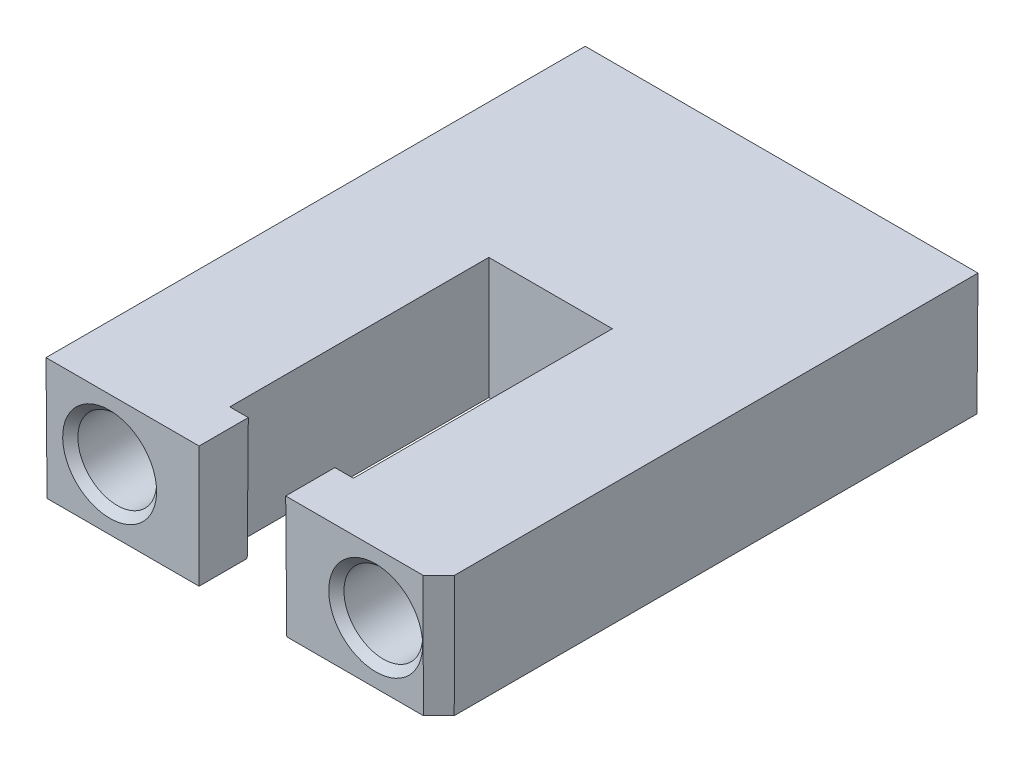
ISO-10303-21;
HEADER;
FILE_DESCRIPTION(('STEP AP214'),'2;1');
FILE_NAME('part.step','',(''),(''),'','','');
FILE_SCHEMA(('AUTOMOTIVE_DESIGN { 1 0 10303 214 1 1 1 1 }'));
ENDSEC;
DATA;
#1=APPLICATION_CONTEXT('core data for automotive mechanical design processes');
#2=APPLICATION_PROTOCOL_DEFINITION('international standard','automotive_design',2000,#1);
#3=PRODUCT_CONTEXT('',#1,'mechanical');
#4=PRODUCT('Part','Part','',(#3));
#5=PRODUCT_RELATED_PRODUCT_CATEGORY('part','',(#4));
#6=PRODUCT_DEFINITION_FORMATION('','',#4);
#7=PRODUCT_DEFINITION_CONTEXT('part definition',#1,'design');
#8=PRODUCT_DEFINITION('design','',#6,#7);
#9=PRODUCT_DEFINITION_SHAPE('','',#8);
#10=(LENGTH_UNIT() NAMED_UNIT(*) SI_UNIT(.MILLI.,.METRE.));
#11=(NAMED_UNIT(*) PLANE_ANGLE_UNIT() SI_UNIT($,.RADIAN.));
#12=(NAMED_UNIT(*) SI_UNIT($,.STERADIAN.) SOLID_ANGLE_UNIT());
#13=UNCERTAINTY_MEASURE_WITH_UNIT(LENGTH_MEASURE(1.E-05),#10,'distance_accuracy_value','');
#14=(GEOMETRIC_REPRESENTATION_CONTEXT(3) GLOBAL_UNCERTAINTY_ASSIGNED_CONTEXT((#13)) GLOBAL_UNIT_ASSIGNED_CONTEXT((#10,
#11,#12)) REPRESENTATION_CONTEXT('',''));
#15=CARTESIAN_POINT('',(0.,0.,0.));
#16=DIRECTION('',(0.,0.,1.));
#17=DIRECTION('',(1.,0.,0.));
#18=AXIS2_PLACEMENT_3D('',#15,#16,#17);
#19=CARTESIAN_POINT('',(-12.6746,3.937,0.));
#20=DIRECTION('',(0.,-0.00436330928474658,0.999990480720734));
#21=DIRECTION('',(0.,-0.999990480720734,-0.00436330928474658));
#22=AXIS2_PLACEMENT_3D('',#19,#20,#21);
#23=PLANE('',#22);
#24=CARTESIAN_POINT('',(-8.5852,0.0132247892107933,-0.0171208077862457));
#25=DIRECTION('',(0.,-0.00436330928474658,0.999990480720734));
#26=DIRECTION('',(0.,0.999990480720734,0.00436330928474658));
#27=AXIS2_PLACEMENT_3D('',#24,#25,#26);
#28=ELLIPSE('',#27,3.03090804427385,3.030850339879);
#29=CARTESIAN_POINT('',(-8.5852,3.04410398142455,-0.00389601857545247));
#30=VERTEX_POINT('',#29);
#31=EDGE_CURVE('E40',#30,#30,#28,.F.);
#32=ORIENTED_EDGE('',*,*,#31,.T.);
#33=EDGE_LOOP('',(#32));
#34=FACE_BOUND('',#33,.T.);
#35=DIRECTION('',(-0.00436326774997777,-0.999980961713314,-0.00436326774997774));
#36=VECTOR('',#35,1.);
#37=CARTESIAN_POINT('',(-2.794,3.937,0.));
#38=LINE('',#37,#36);
#39=CARTESIAN_POINT('',(-2.8283570243622,-3.937,-0.0343570243622042));
#40=VERTEX_POINT('',#39);
#41=CARTESIAN_POINT('',(-2.794,3.937,0.));
#42=VERTEX_POINT('',#41);
#43=EDGE_CURVE('E122',#40,#42,#38,.F.);
#44=ORIENTED_EDGE('',*,*,#43,.T.);
#45=DIRECTION('',(-1.,0.,0.));
#46=VECTOR('',#45,1.);
#47=CARTESIAN_POINT('',(-12.6746,3.937,0.));
#48=LINE('',#47,#46);
#49=CARTESIAN_POINT('',(-12.6746,3.937,0.));
#50=VERTEX_POINT('',#49);
#51=EDGE_CURVE('E117',#42,#50,#48,.T.);
#52=ORIENTED_EDGE('',*,*,#51,.T.);
#53=DIRECTION('',(0.00436326774997771,-0.999980961713314,-0.00436326774997774));
#54=VECTOR('',#53,1.);
#55=CARTESIAN_POINT('',(-12.6746,3.937,0.));
#56=LINE('',#55,#54);
#57=CARTESIAN_POINT('',(-12.6402429756378,-3.937,-0.0343570243622042));
#58=VERTEX_POINT('',#57);
#59=EDGE_CURVE('E121',#50,#58,#56,.T.);
#60=ORIENTED_EDGE('',*,*,#59,.T.);
#61=DIRECTION('',(1.,0.,0.));
#62=VECTOR('',#61,1.);
#63=CARTESIAN_POINT('',(-12.6746,-3.937,-0.0343570243622042));
#64=LINE('',#63,#62);
#65=EDGE_CURVE('E126',#58,#40,#64,.T.);
#66=ORIENTED_EDGE('',*,*,#65,.T.);
#67=EDGE_LOOP('',(#44,#52,#60,#66));
#68=FACE_BOUND('',#67,.T.);
#69=ADVANCED_FACE('F36',(#34,#68),#23,.T.);
#70=CARTESIAN_POINT('',(-12.6746,3.937,-34.798));
#71=DIRECTION('',(-0.999990480720734,-0.00436330928474655,0.));
#72=DIRECTION('',(0.00436330928474655,-0.999990480720734,0.));
#73=AXIS2_PLACEMENT_3D('',#70,#71,#72);
#74=PLANE('',#73);
#75=ORIENTED_EDGE('',*,*,#59,.F.);
#76=DIRECTION('',(0.,0.,1.));
#77=VECTOR('',#76,1.);
#78=CARTESIAN_POINT('',(-12.6746,3.937,-34.798));
#79=LINE('',#78,#77);
#80=CARTESIAN_POINT('',(-12.6746,3.937,-34.798));
#81=VERTEX_POINT('',#80);
#82=EDGE_CURVE('E128',#81,#50,#79,.T.);
#83=ORIENTED_EDGE('',*,*,#82,.F.);
#84=DIRECTION('',(-0.00436326774997771,0.999980961713314,-0.00436326774997774));
#85=VECTOR('',#84,1.);
#86=CARTESIAN_POINT('',(-12.6746,3.937,-34.798));
#87=LINE('',#86,#85);
#88=CARTESIAN_POINT('',(-12.6402429756378,-3.937,-34.7636429756378));
#89=VERTEX_POINT('',#88);
#90=EDGE_CURVE('E154',#81,#89,#87,.F.);
#91=ORIENTED_EDGE('',*,*,#90,.T.);
#92=DIRECTION('',(0.,0.,1.));
#93=VECTOR('',#92,1.);
#94=CARTESIAN_POINT('',(-12.6402429756378,-3.937,-34.798));
#95=LINE('',#94,#93);
#96=EDGE_CURVE('E139',#89,#58,#95,.T.);
#97=ORIENTED_EDGE('',*,*,#96,.T.);
#98=EDGE_LOOP('',(#75,#83,#91,#97));
#99=FACE_BOUND('',#98,.T.);
#100=ADVANCED_FACE('F138',(#99),#74,.T.);
#101=CARTESIAN_POINT('',(-12.6746,3.937,-34.798));
#102=DIRECTION('',(0.,1.,0.));
#103=DIRECTION('',(-1.,0.,0.));
#104=AXIS2_PLACEMENT_3D('',#101,#102,#103);
#105=PLANE('',#104);
#106=CARTESIAN_POINT('',(11.6586,3.937,0.));
#107=VERTEX_POINT('',#106);
#108=CARTESIAN_POINT('',(2.794,3.937,0.));
#109=VERTEX_POINT('',#108);
#110=EDGE_CURVE('E125',#107,#109,#48,.T.);
#111=ORIENTED_EDGE('',*,*,#110,.F.);
#112=DIRECTION('',(-0.707106781186544,0.,0.707106781186551));
#113=VECTOR('',#112,1.);
#114=CARTESIAN_POINT('',(16.8910000000001,3.937,-5.23240000000018));
#115=LINE('',#114,#113);
#116=CARTESIAN_POINT('',(12.6746,3.937,-1.01600000000001));
#117=VERTEX_POINT('',#116);
#118=EDGE_CURVE('E62',#107,#117,#115,.F.);
#119=ORIENTED_EDGE('',*,*,#118,.T.);
#120=DIRECTION('',(0.,0.,1.));
#121=VECTOR('',#120,1.);
#122=CARTESIAN_POINT('',(12.6746,3.937,-34.798));
#123=LINE('',#122,#121);
#124=CARTESIAN_POINT('',(12.6746,3.937,-34.798));
#125=VERTEX_POINT('',#124);
#126=EDGE_CURVE('E107',#125,#117,#123,.T.);
#127=ORIENTED_EDGE('',*,*,#126,.F.);
#128=DIRECTION('',(-1.,0.,0.));
#129=VECTOR('',#128,1.);
#130=CARTESIAN_POINT('',(-12.6746,3.937,-34.798));
#131=LINE('',#130,#129);
#132=EDGE_CURVE('E131',#125,#81,#131,.T.);
#133=ORIENTED_EDGE('',*,*,#132,.T.);
#134=ORIENTED_EDGE('',*,*,#82,.T.);
#135=ORIENTED_EDGE('',*,*,#51,.F.);
#136=DIRECTION('',(0.,0.,1.));
#137=VECTOR('',#136,1.);
#138=CARTESIAN_POINT('',(-2.794,3.937,0.));
#139=LINE('',#138,#137);
#140=CARTESIAN_POINT('',(-2.794,3.937,-3.175));
#141=VERTEX_POINT('',#140);
#142=EDGE_CURVE('E165',#141,#42,#139,.T.);
#143=ORIENTED_EDGE('',*,*,#142,.F.);
#144=DIRECTION('',(1.,0.,0.));
#145=VECTOR('',#144,1.);
#146=CARTESIAN_POINT('',(-2.794,3.937,-3.175));
#147=LINE('',#146,#145);
#148=CARTESIAN_POINT('',(-3.9878,3.937,-3.175));
#149=VERTEX_POINT('',#148);
#150=EDGE_CURVE('E257',#149,#141,#147,.T.);
#151=ORIENTED_EDGE('',*,*,#150,.F.);
#152=DIRECTION('',(0.,0.,1.));
#153=VECTOR('',#152,1.);
#154=CARTESIAN_POINT('',(-3.9878,3.937,-3.175));
#155=LINE('',#154,#153);
#156=CARTESIAN_POINT('',(-3.9878,3.937,-19.8882));
#157=VERTEX_POINT('',#156);
#158=EDGE_CURVE('E262',#157,#149,#155,.T.);
#159=ORIENTED_EDGE('',*,*,#158,.F.);
#160=DIRECTION('',(-1.,0.,0.));
#161=VECTOR('',#160,1.);
#162=CARTESIAN_POINT('',(-3.9878,3.937,-19.8882));
#163=LINE('',#162,#161);
#164=CARTESIAN_POINT('',(3.9878,3.937,-19.8882));
#165=VERTEX_POINT('',#164);
#166=EDGE_CURVE('E303',#165,#157,#163,.T.);
#167=ORIENTED_EDGE('',*,*,#166,.F.);
#168=DIRECTION('',(0.,0.,-1.));
#169=VECTOR('',#168,1.);
#170=CARTESIAN_POINT('',(3.9878,3.937,-19.8882));
#171=LINE('',#170,#169);
#172=CARTESIAN_POINT('',(3.9878,3.937,-3.175));
#173=VERTEX_POINT('',#172);
#174=EDGE_CURVE('E293',#173,#165,#171,.T.);
#175=ORIENTED_EDGE('',*,*,#174,.F.);
#176=DIRECTION('',(1.,0.,0.));
#177=VECTOR('',#176,1.);
#178=CARTESIAN_POINT('',(3.9878,3.937,-3.175));
#179=LINE('',#178,#177);
#180=CARTESIAN_POINT('',(2.794,3.937,-3.175));
#181=VERTEX_POINT('',#180);
#182=EDGE_CURVE('E289',#181,#173,#179,.T.);
#183=ORIENTED_EDGE('',*,*,#182,.F.);
#184=DIRECTION('',(0.,0.,-1.));
#185=VECTOR('',#184,1.);
#186=CARTESIAN_POINT('',(2.794,3.937,-3.175));
#187=LINE('',#186,#185);
#188=EDGE_CURVE('E285',#109,#181,#187,.T.);
#189=ORIENTED_EDGE('',*,*,#188,.F.);
#190=EDGE_LOOP('',(#111,#119,#127,#133,#134,#135,#143,#151,#159,#167,#175,#183,#189));
#191=FACE_BOUND('',#190,.T.);
#192=ADVANCED_FACE('F129',(#191),#105,.T.);
#193=CARTESIAN_POINT('',(12.6746,3.937,-34.798));
#194=DIRECTION('',(0.999990480720734,-0.00436330928474661,0.));
#195=DIRECTION('',(0.00436330928474661,0.999990480720734,0.));
#196=AXIS2_PLACEMENT_3D('',#193,#194,#195);
#197=PLANE('',#196);
#198=ORIENTED_EDGE('',*,*,#126,.T.);
#199=DIRECTION('',(-0.00436330215842261,-0.999988847497943,-0.00180733893075041));
#200=VECTOR('',#199,1.);
#201=CARTESIAN_POINT('',(12.6743335963014,3.87594515716325,-1.01611034802503));
#202=LINE('',#201,#200);
#203=CARTESIAN_POINT('',(12.6402429756378,-3.937,-1.03023114545361));
#204=VERTEX_POINT('',#203);
#205=EDGE_CURVE('E46',#117,#204,#202,.T.);
#206=ORIENTED_EDGE('',*,*,#205,.T.);
#207=DIRECTION('',(0.,0.,1.));
#208=VECTOR('',#207,1.);
#209=CARTESIAN_POINT('',(12.6402429756378,-3.937,-34.798));
#210=LINE('',#209,#208);
#211=CARTESIAN_POINT('',(12.6402429756378,-3.937,-34.7636429756378));
#212=VERTEX_POINT('',#211);
#213=EDGE_CURVE('E103',#212,#204,#210,.T.);
#214=ORIENTED_EDGE('',*,*,#213,.F.);
#215=DIRECTION('',(-0.00436326774997777,-0.999980961713314,0.00436326774997774));
#216=VECTOR('',#215,1.);
#217=CARTESIAN_POINT('',(12.6741173992571,3.82639675888857,-34.7975173992571));
#218=LINE('',#217,#216);
#219=EDGE_CURVE('E158',#212,#125,#218,.F.);
#220=ORIENTED_EDGE('',*,*,#219,.T.);
#221=EDGE_LOOP('',(#198,#206,#214,#220));
#222=FACE_BOUND('',#221,.T.);
#223=ADVANCED_FACE('F360',(#222),#197,.T.);
#224=CARTESIAN_POINT('',(-12.6746,-3.937,-34.798));
#225=DIRECTION('',(0.,-1.,0.));
#226=DIRECTION('',(0.,0.,-1.));
#227=AXIS2_PLACEMENT_3D('',#224,#225,#226);
#228=PLANE('',#227);
#229=ORIENTED_EDGE('',*,*,#213,.T.);
#230=DIRECTION('',(-0.707106781186544,0.,0.707106781186551));
#231=VECTOR('',#230,1.);
#232=CARTESIAN_POINT('',(16.8667059150922,-3.937,-5.25669408490809));
#233=LINE('',#232,#231);
#234=CARTESIAN_POINT('',(11.6443688545464,-3.937,-0.0343570243622042));
#235=VERTEX_POINT('',#234);
#236=EDGE_CURVE('E11',#204,#235,#233,.T.);
#237=ORIENTED_EDGE('',*,*,#236,.T.);
#238=DIRECTION('',(1.,0.,0.));
#239=VECTOR('',#238,1.);
#240=CARTESIAN_POINT('',(-12.6746,-3.937,-0.0343570243622042));
#241=LINE('',#240,#239);
#242=CARTESIAN_POINT('',(2.8283570243622,-3.937,-0.0343570243622042));
#243=VERTEX_POINT('',#242);
#244=EDGE_CURVE('E142',#243,#235,#241,.T.);
#245=ORIENTED_EDGE('',*,*,#244,.F.);
#246=DIRECTION('',(0.,0.,1.));
#247=VECTOR('',#246,1.);
#248=CARTESIAN_POINT('',(2.8283570243622,-3.937,-3.175));
#249=LINE('',#248,#247);
#250=CARTESIAN_POINT('',(2.8283570243622,-3.937,-3.1406429756378));
#251=VERTEX_POINT('',#250);
#252=EDGE_CURVE('E160',#243,#251,#249,.F.);
#253=ORIENTED_EDGE('',*,*,#252,.T.);
#254=DIRECTION('',(-1.,0.,0.));
#255=VECTOR('',#254,1.);
#256=CARTESIAN_POINT('',(3.9878,-3.937,-3.14064297563779));
#257=LINE('',#256,#255);
#258=CARTESIAN_POINT('',(4.0221570243622,-3.937,-3.14064297563779));
#259=VERTEX_POINT('',#258);
#260=EDGE_CURVE('E164',#251,#259,#257,.F.);
#261=ORIENTED_EDGE('',*,*,#260,.T.);
#262=DIRECTION('',(0.,0.,1.));
#263=VECTOR('',#262,1.);
#264=CARTESIAN_POINT('',(4.0221570243622,-3.937,-19.8882));
#265=LINE('',#264,#263);
#266=CARTESIAN_POINT('',(4.0221570243622,-3.937,-19.9225570243622));
#267=VERTEX_POINT('',#266);
#268=EDGE_CURVE('E169',#259,#267,#265,.F.);
#269=ORIENTED_EDGE('',*,*,#268,.T.);
#270=DIRECTION('',(1.,0.,0.));
#271=VECTOR('',#270,1.);
#272=CARTESIAN_POINT('',(-3.9878,-3.937,-19.9225570243622));
#273=LINE('',#272,#271);
#274=CARTESIAN_POINT('',(-4.0221570243622,-3.937,-19.9225570243622));
#275=VERTEX_POINT('',#274);
#276=EDGE_CURVE('E173',#267,#275,#273,.F.);
#277=ORIENTED_EDGE('',*,*,#276,.T.);
#278=DIRECTION('',(0.,0.,-1.));
#279=VECTOR('',#278,1.);
#280=CARTESIAN_POINT('',(-4.0221570243622,-3.937,-3.175));
#281=LINE('',#280,#279);
#282=CARTESIAN_POINT('',(-4.0221570243622,-3.937,-3.14064297563779));
#283=VERTEX_POINT('',#282);
#284=EDGE_CURVE('E177',#275,#283,#281,.F.);
#285=ORIENTED_EDGE('',*,*,#284,.T.);
#286=DIRECTION('',(-1.,0.,0.));
#287=VECTOR('',#286,1.);
#288=CARTESIAN_POINT('',(-2.794,-3.937,-3.1406429756378));
#289=LINE('',#288,#287);
#290=CARTESIAN_POINT('',(-2.8283570243622,-3.937,-3.1406429756378));
#291=VERTEX_POINT('',#290);
#292=EDGE_CURVE('E181',#283,#291,#289,.F.);
#293=ORIENTED_EDGE('',*,*,#292,.T.);
#294=DIRECTION('',(0.,0.,-1.));
#295=VECTOR('',#294,1.);
#296=CARTESIAN_POINT('',(-2.8283570243622,-3.937,0.));
#297=LINE('',#296,#295);
#298=EDGE_CURVE('E185',#291,#40,#297,.F.);
#299=ORIENTED_EDGE('',*,*,#298,.T.);
#300=ORIENTED_EDGE('',*,*,#65,.F.);
#301=ORIENTED_EDGE('',*,*,#96,.F.);
#302=DIRECTION('',(-1.,0.,0.));
#303=VECTOR('',#302,1.);
#304=CARTESIAN_POINT('',(-12.6746,-3.937,-34.7636429756378));
#305=LINE('',#304,#303);
#306=EDGE_CURVE('E157',#89,#212,#305,.F.);
#307=ORIENTED_EDGE('',*,*,#306,.T.);
#308=EDGE_LOOP('',(#229,#237,#245,#253,#261,#269,#277,#285,#293,#299,#300,#301,#307));
#309=FACE_BOUND('',#308,.T.);
#310=ADVANCED_FACE('F357',(#309),#228,.T.);
#311=CARTESIAN_POINT('',(-12.6746,3.937,-34.798));
#312=DIRECTION('',(0.,-0.00436330928474658,-0.999990480720734));
#313=DIRECTION('',(0.,0.999990480720734,-0.00436330928474658));
#314=AXIS2_PLACEMENT_3D('',#311,#312,#313);
#315=PLANE('',#314);
#316=ORIENTED_EDGE('',*,*,#90,.F.);
#317=ORIENTED_EDGE('',*,*,#132,.F.);
#318=ORIENTED_EDGE('',*,*,#219,.F.);
#319=ORIENTED_EDGE('',*,*,#306,.F.);
#320=EDGE_LOOP('',(#316,#317,#318,#319));
#321=FACE_BOUND('',#320,.T.);
#322=ADVANCED_FACE('F355',(#321),#315,.T.);
#323=CARTESIAN_POINT('',(-12.6746,3.937,0.));
#324=DIRECTION('',(0.,-0.00436330928474658,0.999990480720734));
#325=DIRECTION('',(0.,-0.999990480720734,-0.00436330928474658));
#326=AXIS2_PLACEMENT_3D('',#323,#324,#325);
#327=PLANE('',#326);
#328=CARTESIAN_POINT('',(8.5852,0.0132247892107933,-0.0171208077862457));
#329=DIRECTION('',(0.,-0.00436330928474658,0.999990480720734));
#330=DIRECTION('',(0.,0.999990480720734,0.00436330928474658));
#331=AXIS2_PLACEMENT_3D('',#328,#329,#330);
#332=ELLIPSE('',#331,3.03090804427385,3.030850339879);
#333=CARTESIAN_POINT('',(8.5852,3.04410398142455,-0.00389601857545247));
#334=VERTEX_POINT('',#333);
#335=EDGE_CURVE('E198',#334,#334,#332,.F.);
#336=ORIENTED_EDGE('',*,*,#335,.T.);
#337=EDGE_LOOP('',(#336));
#338=FACE_BOUND('',#337,.T.);
#339=ORIENTED_EDGE('',*,*,#244,.T.);
#340=DIRECTION('',(0.00180733893075047,0.999988847497943,0.00436330215842257));
#341=VECTOR('',#340,1.);
#342=CARTESIAN_POINT('',(11.6585205162346,3.89302215079879,-0.000191890784404803));
#343=LINE('',#342,#341);
#344=EDGE_CURVE('E218',#235,#107,#343,.T.);
#345=ORIENTED_EDGE('',*,*,#344,.T.);
#346=ORIENTED_EDGE('',*,*,#110,.T.);
#347=DIRECTION('',(0.00436326774997771,-0.999980961713314,-0.00436326774997774));
#348=VECTOR('',#347,1.);
#349=CARTESIAN_POINT('',(2.79370550716191,4.00449235855397,0.000294492838087554));
#350=LINE('',#349,#348);
#351=EDGE_CURVE('E189',#243,#109,#350,.F.);
#352=ORIENTED_EDGE('',*,*,#351,.F.);
#353=EDGE_LOOP('',(#339,#345,#346,#352));
#354=FACE_BOUND('',#353,.T.);
#355=ADVANCED_FACE('F275',(#338,#354),#327,.T.);
#356=CARTESIAN_POINT('',(-2.794,3.937,0.));
#357=DIRECTION('',(0.999990480720734,-0.00436330928474661,0.));
#358=DIRECTION('',(0.00436330928474661,0.999990480720734,0.));
#359=AXIS2_PLACEMENT_3D('',#356,#357,#358);
#360=PLANE('',#359);
#361=ORIENTED_EDGE('',*,*,#142,.T.);
#362=ORIENTED_EDGE('',*,*,#43,.F.);
#363=ORIENTED_EDGE('',*,*,#298,.F.);
#364=DIRECTION('',(0.00436326774997777,0.999980961713314,-0.00436326774997774));
#365=VECTOR('',#364,1.);
#366=CARTESIAN_POINT('',(-2.79406044598483,3.92314688863835,-3.17493955401517));
#367=LINE('',#366,#365);
#368=EDGE_CURVE('E150',#291,#141,#367,.T.);
#369=ORIENTED_EDGE('',*,*,#368,.T.);
#370=EDGE_LOOP('',(#361,#362,#363,#369));
#371=FACE_BOUND('',#370,.T.);
#372=ADVANCED_FACE('F252',(#371),#360,.T.);
#373=CARTESIAN_POINT('',(-2.794,3.937,-3.175));
#374=DIRECTION('',(0.,-0.00436330928474658,-0.999990480720734));
#375=DIRECTION('',(0.,0.999990480720734,-0.00436330928474658));
#376=AXIS2_PLACEMENT_3D('',#373,#374,#375);
#377=PLANE('',#376);
#378=ORIENTED_EDGE('',*,*,#150,.T.);
#379=ORIENTED_EDGE('',*,*,#368,.F.);
#380=ORIENTED_EDGE('',*,*,#292,.F.);
#381=DIRECTION('',(0.00436326774997777,0.999980961713314,-0.00436326774997774));
#382=VECTOR('',#381,1.);
#383=CARTESIAN_POINT('',(-3.9878,3.937,-3.175));
#384=LINE('',#383,#382);
#385=EDGE_CURVE('E242',#283,#149,#384,.T.);
#386=ORIENTED_EDGE('',*,*,#385,.T.);
#387=EDGE_LOOP('',(#378,#379,#380,#386));
#388=FACE_BOUND('',#387,.T.);
#389=ADVANCED_FACE('F258',(#388),#377,.T.);
#390=CARTESIAN_POINT('',(-3.9878,3.937,-3.175));
#391=DIRECTION('',(0.999990480720734,-0.00436330928474661,0.));
#392=DIRECTION('',(0.00436330928474661,0.999990480720734,0.));
#393=AXIS2_PLACEMENT_3D('',#390,#391,#392);
#394=PLANE('',#393);
#395=ORIENTED_EDGE('',*,*,#158,.T.);
#396=ORIENTED_EDGE('',*,*,#385,.F.);
#397=ORIENTED_EDGE('',*,*,#284,.F.);
#398=DIRECTION('',(0.00436326774997777,0.999980961713314,0.00436326774997774));
#399=VECTOR('',#398,1.);
#400=CARTESIAN_POINT('',(-3.9878,3.937,-19.8882));
#401=LINE('',#400,#399);
#402=EDGE_CURVE('E238',#275,#157,#401,.T.);
#403=ORIENTED_EDGE('',*,*,#402,.T.);
#404=EDGE_LOOP('',(#395,#396,#397,#403));
#405=FACE_BOUND('',#404,.T.);
#406=ADVANCED_FACE('F38',(#405),#394,.T.);
#407=CARTESIAN_POINT('',(-3.9878,3.937,-19.8882));
#408=DIRECTION('',(0.,-0.00436330928474658,0.999990480720734));
#409=DIRECTION('',(0.,-0.999990480720734,-0.00436330928474658));
#410=AXIS2_PLACEMENT_3D('',#407,#408,#409);
#411=PLANE('',#410);
#412=ORIENTED_EDGE('',*,*,#166,.T.);
#413=ORIENTED_EDGE('',*,*,#402,.F.);
#414=ORIENTED_EDGE('',*,*,#276,.F.);
#415=DIRECTION('',(-0.00436326774997771,0.999980961713314,0.00436326774997774));
#416=VECTOR('',#415,1.);
#417=CARTESIAN_POINT('',(3.9878,3.937,-19.8882));
#418=LINE('',#417,#416);
#419=EDGE_CURVE('E235',#267,#165,#418,.T.);
#420=ORIENTED_EDGE('',*,*,#419,.T.);
#421=EDGE_LOOP('',(#412,#413,#414,#420));
#422=FACE_BOUND('',#421,.T.);
#423=ADVANCED_FACE('F375',(#422),#411,.T.);
#424=CARTESIAN_POINT('',(3.9878,3.937,-19.8882));
#425=DIRECTION('',(-0.999990480720734,-0.00436330928474655,0.));
#426=DIRECTION('',(0.00436330928474655,-0.999990480720734,0.));
#427=AXIS2_PLACEMENT_3D('',#424,#425,#426);
#428=PLANE('',#427);
#429=ORIENTED_EDGE('',*,*,#174,.T.);
#430=ORIENTED_EDGE('',*,*,#419,.F.);
#431=ORIENTED_EDGE('',*,*,#268,.F.);
#432=DIRECTION('',(-0.00436326774997771,0.999980961713314,-0.00436326774997774));
#433=VECTOR('',#432,1.);
#434=CARTESIAN_POINT('',(3.9878,3.937,-3.175));
#435=LINE('',#434,#433);
#436=EDGE_CURVE('E231',#259,#173,#435,.T.);
#437=ORIENTED_EDGE('',*,*,#436,.T.);
#438=EDGE_LOOP('',(#429,#430,#431,#437));
#439=FACE_BOUND('',#438,.T.);
#440=ADVANCED_FACE('F368',(#439),#428,.T.);
#441=CARTESIAN_POINT('',(3.9878,3.937,-3.175));
#442=DIRECTION('',(0.,-0.00436330928474658,-0.999990480720734));
#443=DIRECTION('',(0.,0.999990480720734,-0.00436330928474658));
#444=AXIS2_PLACEMENT_3D('',#441,#442,#443);
#445=PLANE('',#444);
#446=ORIENTED_EDGE('',*,*,#182,.T.);
#447=ORIENTED_EDGE('',*,*,#436,.F.);
#448=ORIENTED_EDGE('',*,*,#260,.F.);
#449=DIRECTION('',(-0.00436326774997771,0.999980961713314,-0.00436326774997774));
#450=VECTOR('',#449,1.);
#451=CARTESIAN_POINT('',(2.7940227276903,3.93179123012802,-3.1749772723097));
#452=LINE('',#451,#450);
#453=EDGE_CURVE('E227',#251,#181,#452,.T.);
#454=ORIENTED_EDGE('',*,*,#453,.T.);
#455=EDGE_LOOP('',(#446,#447,#448,#454));
#456=FACE_BOUND('',#455,.T.);
#457=ADVANCED_FACE('F365',(#456),#445,.T.);
#458=CARTESIAN_POINT('',(2.794,3.937,-3.175));
#459=DIRECTION('',(-0.999990480720734,-0.00436330928474655,0.));
#460=DIRECTION('',(0.00436330928474655,-0.999990480720734,0.));
#461=AXIS2_PLACEMENT_3D('',#458,#459,#460);
#462=PLANE('',#461);
#463=ORIENTED_EDGE('',*,*,#188,.T.);
#464=ORIENTED_EDGE('',*,*,#453,.F.);
#465=ORIENTED_EDGE('',*,*,#252,.F.);
#466=ORIENTED_EDGE('',*,*,#351,.T.);
#467=EDGE_LOOP('',(#463,#464,#465,#466));
#468=FACE_BOUND('',#467,.T.);
#469=ADVANCED_FACE('F284',(#468),#462,.T.);
#470=CARTESIAN_POINT('',(8.5852,0.,-12.7));
#471=DIRECTION('',(0.,0.,1.));
#472=DIRECTION('',(1.,0.,0.));
#473=AXIS2_PLACEMENT_3D('',#470,#471,#472);
#474=CONICAL_SURFACE('',#473,2.54,1.02974425867665);
#475=CARTESIAN_POINT('',(8.5852,0.,-14.22618597233));
#476=VERTEX_POINT('',#475);
#477=VERTEX_LOOP('',#476);
#478=FACE_BOUND('',#477,.T.);
#479=CARTESIAN_POINT('',(8.5852,0.,-12.7));
#480=DIRECTION('',(0.,0.,1.));
#481=DIRECTION('',(1.,0.,0.));
#482=AXIS2_PLACEMENT_3D('',#479,#480,#481);
#483=CIRCLE('',#482,2.54);
#484=CARTESIAN_POINT('',(11.1252,0.,-12.7));
#485=VERTEX_POINT('',#484);
#486=EDGE_CURVE('E290',#485,#485,#483,.T.);
#487=ORIENTED_EDGE('',*,*,#486,.T.);
#488=EDGE_LOOP('',(#487));
#489=FACE_BOUND('',#488,.T.);
#490=ADVANCED_FACE('F372',(#478,#489),#474,.F.);
#491=CARTESIAN_POINT('',(8.5852,0.,0.));
#492=DIRECTION('',(0.,0.,1.));
#493=DIRECTION('',(1.,0.,0.));
#494=AXIS2_PLACEMENT_3D('',#491,#492,#493);
#495=CYLINDRICAL_SURFACE('',#494,2.54);
#496=CARTESIAN_POINT('',(8.5852,0.,-0.507999999999995));
#497=DIRECTION('',(0.,0.,1.));
#498=DIRECTION('',(1.,0.,0.));
#499=AXIS2_PLACEMENT_3D('',#496,#497,#498);
#500=CIRCLE('',#499,2.54);
#501=CARTESIAN_POINT('',(11.1252,0.,-0.507999999999995));
#502=VERTEX_POINT('',#501);
#503=EDGE_CURVE('E136',#502,#502,#500,.T.);
#504=ORIENTED_EDGE('',*,*,#503,.T.);
#505=EDGE_LOOP('',(#504));
#506=FACE_BOUND('',#505,.T.);
#507=ORIENTED_EDGE('',*,*,#486,.F.);
#508=EDGE_LOOP('',(#507));
#509=FACE_BOUND('',#508,.T.);
#510=ADVANCED_FACE('F329',(#506,#509),#495,.F.);
#511=CARTESIAN_POINT('',(-8.5852,0.,-12.7));
#512=DIRECTION('',(0.,0.,1.));
#513=DIRECTION('',(1.,0.,0.));
#514=AXIS2_PLACEMENT_3D('',#511,#512,#513);
#515=CONICAL_SURFACE('',#514,2.54,1.02974425867665);
#516=CARTESIAN_POINT('',(-8.5852,0.,-14.22618597233));
#517=VERTEX_POINT('',#516);
#518=VERTEX_LOOP('',#517);
#519=FACE_BOUND('',#518,.T.);
#520=CARTESIAN_POINT('',(-8.5852,0.,-12.7));
#521=DIRECTION('',(0.,0.,1.));
#522=DIRECTION('',(1.,0.,0.));
#523=AXIS2_PLACEMENT_3D('',#520,#521,#522);
#524=CIRCLE('',#523,2.54);
#525=CARTESIAN_POINT('',(-6.0452,0.,-12.7));
#526=VERTEX_POINT('',#525);
#527=EDGE_CURVE('E297',#526,#526,#524,.T.);
#528=ORIENTED_EDGE('',*,*,#527,.T.);
#529=EDGE_LOOP('',(#528));
#530=FACE_BOUND('',#529,.T.);
#531=ADVANCED_FACE('F325',(#519,#530),#515,.F.);
#532=CARTESIAN_POINT('',(-8.5852,0.,0.));
#533=DIRECTION('',(0.,0.,1.));
#534=DIRECTION('',(1.,0.,0.));
#535=AXIS2_PLACEMENT_3D('',#532,#533,#534);
#536=CYLINDRICAL_SURFACE('',#535,2.54);
#537=CARTESIAN_POINT('',(-8.5852,0.,-0.507999999999995));
#538=DIRECTION('',(0.,0.,1.));
#539=DIRECTION('',(1.,0.,0.));
#540=AXIS2_PLACEMENT_3D('',#537,#538,#539);
#541=CIRCLE('',#540,2.54);
#542=CARTESIAN_POINT('',(-6.0452,0.,-0.507999999999995));
#543=VERTEX_POINT('',#542);
#544=EDGE_CURVE('E201',#543,#543,#541,.T.);
#545=ORIENTED_EDGE('',*,*,#544,.T.);
#546=EDGE_LOOP('',(#545));
#547=FACE_BOUND('',#546,.T.);
#548=ORIENTED_EDGE('',*,*,#527,.F.);
#549=EDGE_LOOP('',(#548));
#550=FACE_BOUND('',#549,.T.);
#551=ADVANCED_FACE('F328',(#547,#550),#536,.F.);
#552=CARTESIAN_POINT('',(8.5852,0.,-0.507999999999995));
#553=DIRECTION('',(0.,0.,1.));
#554=DIRECTION('',(1.,0.,0.));
#555=AXIS2_PLACEMENT_3D('',#552,#553,#554);
#556=CONICAL_SURFACE('',#555,2.54,0.785398163397453);
#557=ORIENTED_EDGE('',*,*,#335,.F.);
#558=EDGE_LOOP('',(#557));
#559=FACE_BOUND('',#558,.T.);
#560=ORIENTED_EDGE('',*,*,#503,.F.);
#561=EDGE_LOOP('',(#560));
#562=FACE_BOUND('',#561,.T.);
#563=ADVANCED_FACE('F335',(#559,#562),#556,.F.);
#564=CARTESIAN_POINT('',(-8.5852,0.,-0.507999999999995));
#565=DIRECTION('',(0.,0.,1.));
#566=DIRECTION('',(1.,0.,0.));
#567=AXIS2_PLACEMENT_3D('',#564,#565,#566);
#568=CONICAL_SURFACE('',#567,2.54,0.785398163397453);
#569=ORIENTED_EDGE('',*,*,#31,.F.);
#570=EDGE_LOOP('',(#569));
#571=FACE_BOUND('',#570,.T.);
#572=ORIENTED_EDGE('',*,*,#544,.F.);
#573=EDGE_LOOP('',(#572));
#574=FACE_BOUND('',#573,.T.);
#575=ADVANCED_FACE('F341',(#571,#574),#568,.F.);
#576=CARTESIAN_POINT('',(16.8910000000001,3.937,-5.23240000000018));
#577=DIRECTION('',(0.707100050039631,-0.0043633092847466,0.707100050039623));
#578=DIRECTION('',(0.707106781186544,0.,-0.707106781186551));
#579=AXIS2_PLACEMENT_3D('',#576,#577,#578);
#580=PLANE('',#579);
#581=ORIENTED_EDGE('',*,*,#236,.F.);
#582=ORIENTED_EDGE('',*,*,#205,.F.);
#583=ORIENTED_EDGE('',*,*,#118,.F.);
#584=ORIENTED_EDGE('',*,*,#344,.F.);
#585=EDGE_LOOP('',(#581,#582,#583,#584));
#586=FACE_BOUND('',#585,.T.);
#587=ADVANCED_FACE('F389',(#586),#580,.T.);
#588=CLOSED_SHELL('',(#69,#100,#192,#223,#310,#322,#355,#372,#389,#406,#423,#440,#457,#469,#490,
#510,#531,#551,#563,#575,#587));
#589=MANIFOLD_SOLID_BREP('B2',#588);
#590=ADVANCED_BREP_SHAPE_REPRESENTATION('',(#18,#589),#14);
#591=SHAPE_DEFINITION_REPRESENTATION(#9,#590);
ENDSEC;
END-ISO-10303-21;
